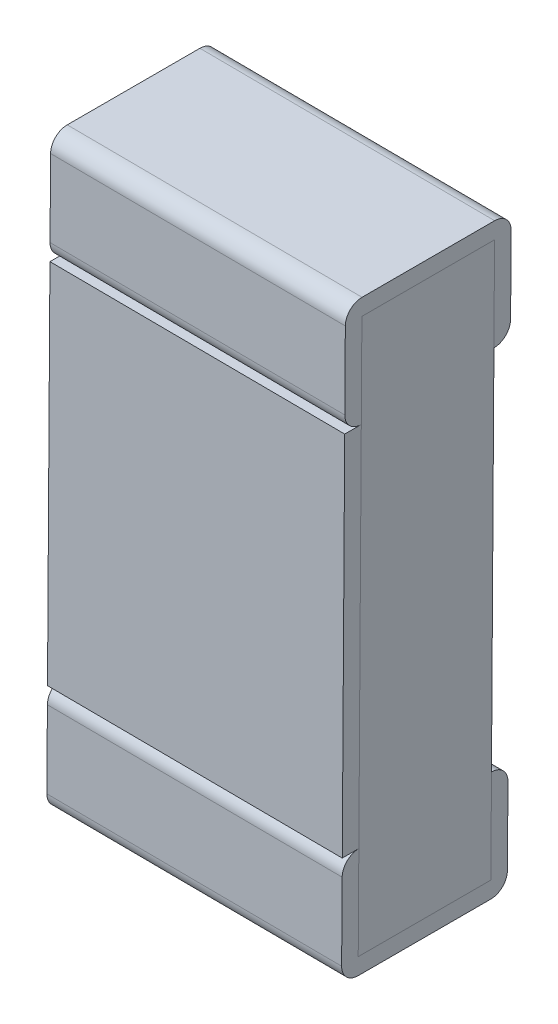
ISO-10303-21;
HEADER;
FILE_DESCRIPTION(('STEP AP214'),'2;1');
FILE_NAME('part.step','',(''),(''),'','','');
FILE_SCHEMA(('AUTOMOTIVE_DESIGN { 1 0 10303 214 1 1 1 1 }'));
ENDSEC;
DATA;
#1=APPLICATION_CONTEXT('core data for automotive mechanical design processes');
#2=APPLICATION_PROTOCOL_DEFINITION('international standard','automotive_design',2000,#1);
#3=PRODUCT_CONTEXT('',#1,'mechanical');
#4=PRODUCT('Part','Part','',(#3));
#5=PRODUCT_RELATED_PRODUCT_CATEGORY('part','',(#4));
#6=PRODUCT_DEFINITION_FORMATION('','',#4);
#7=PRODUCT_DEFINITION_CONTEXT('part definition',#1,'design');
#8=PRODUCT_DEFINITION('design','',#6,#7);
#9=PRODUCT_DEFINITION_SHAPE('','',#8);
#10=(LENGTH_UNIT() NAMED_UNIT(*) SI_UNIT(.MILLI.,.METRE.));
#11=(NAMED_UNIT(*) PLANE_ANGLE_UNIT() SI_UNIT($,.RADIAN.));
#12=(NAMED_UNIT(*) SI_UNIT($,.STERADIAN.) SOLID_ANGLE_UNIT());
#13=UNCERTAINTY_MEASURE_WITH_UNIT(LENGTH_MEASURE(1.E-05),#10,'distance_accuracy_value','');
#14=(GEOMETRIC_REPRESENTATION_CONTEXT(3) GLOBAL_UNCERTAINTY_ASSIGNED_CONTEXT((#13)) GLOBAL_UNIT_ASSIGNED_CONTEXT((#10,
#11,#12)) REPRESENTATION_CONTEXT('',''));
#15=CARTESIAN_POINT('',(0.,0.,0.));
#16=DIRECTION('',(0.,0.,1.));
#17=DIRECTION('',(1.,0.,0.));
#18=AXIS2_PLACEMENT_3D('',#15,#16,#17);
#19=CARTESIAN_POINT('',(212.691130229645,105.302320870175,142.661582908599));
#20=DIRECTION('',(0.,0.,1.));
#21=DIRECTION('',(1.,0.,0.));
#22=AXIS2_PLACEMENT_3D('',#19,#20,#21);
#23=PLANE('',#22);
#24=DIRECTION('',(-0.999978016708569,0.00663069374923689,0.));
#25=VECTOR('',#24,1.);
#26=CARTESIAN_POINT('',(212.691130229645,105.302320870175,142.661582908599));
#27=LINE('',#26,#25);
#28=CARTESIAN_POINT('',(212.691130229645,105.302320870175,142.661582908599));
#29=VERTEX_POINT('',#28);
#30=CARTESIAN_POINT('',(211.891147816278,105.307625425175,142.661582908599));
#31=VERTEX_POINT('',#30);
#32=EDGE_CURVE('E67',#29,#31,#27,.T.);
#33=ORIENTED_EDGE('',*,*,#32,.F.);
#34=DIRECTION('',(0.00663069374923689,0.999978016708569,0.));
#35=VECTOR('',#34,1.);
#36=CARTESIAN_POINT('',(212.691130229645,105.302320870175,142.661582908599));
#37=LINE('',#36,#35);
#38=CARTESIAN_POINT('',(212.697760923394,106.302298886884,142.661582908599));
#39=VERTEX_POINT('',#38);
#40=EDGE_CURVE('E11',#29,#39,#37,.T.);
#41=ORIENTED_EDGE('',*,*,#40,.T.);
#42=DIRECTION('',(-0.999978016708569,0.00663069374923689,0.));
#43=VECTOR('',#42,1.);
#44=CARTESIAN_POINT('',(212.697760923394,106.302298886884,142.661582908599));
#45=LINE('',#44,#43);
#46=CARTESIAN_POINT('',(211.897778510027,106.307603441883,142.661582908599));
#47=VERTEX_POINT('',#46);
#48=EDGE_CURVE('E55',#39,#47,#45,.T.);
#49=ORIENTED_EDGE('',*,*,#48,.T.);
#50=DIRECTION('',(0.00663069374923689,0.999978016708569,0.));
#51=VECTOR('',#50,1.);
#52=CARTESIAN_POINT('',(211.891147816278,105.307625425175,142.661582908599));
#53=LINE('',#52,#51);
#54=EDGE_CURVE('E311',#31,#47,#53,.T.);
#55=ORIENTED_EDGE('',*,*,#54,.F.);
#56=EDGE_LOOP('',(#33,#41,#49,#55));
#57=FACE_BOUND('',#56,.T.);
#58=ADVANCED_FACE('F44',(#57),#23,.T.);
#59=CARTESIAN_POINT('',(212.697760923394,106.302298886884,142.616582908599));
#60=DIRECTION('',(0.00663069374923689,0.99997801670857,0.));
#61=DIRECTION('',(0.,0.,-1.));
#62=AXIS2_PLACEMENT_3D('',#59,#60,#61);
#63=PLANE('',#62);
#64=DIRECTION('',(0.,0.,1.));
#65=VECTOR('',#64,1.);
#66=CARTESIAN_POINT('',(212.697760923394,106.302298886884,142.616582908599));
#67=LINE('',#66,#65);
#68=CARTESIAN_POINT('',(212.697760923394,106.302298886884,142.616582908599));
#69=VERTEX_POINT('',#68);
#70=EDGE_CURVE('E387',#69,#39,#67,.T.);
#71=ORIENTED_EDGE('',*,*,#70,.F.);
#72=DIRECTION('',(-0.999978016708569,0.00663069374923689,0.));
#73=VECTOR('',#72,1.);
#74=CARTESIAN_POINT('',(212.697760923394,106.302298886884,142.616582908599));
#75=LINE('',#74,#73);
#76=CARTESIAN_POINT('',(211.897778510027,106.307603441883,142.616582908599));
#77=VERTEX_POINT('',#76);
#78=EDGE_CURVE('E349',#69,#77,#75,.T.);
#79=ORIENTED_EDGE('',*,*,#78,.T.);
#80=DIRECTION('',(0.,0.,1.));
#81=VECTOR('',#80,1.);
#82=CARTESIAN_POINT('',(211.897778510027,106.307603441883,142.616582908599));
#83=LINE('',#82,#81);
#84=EDGE_CURVE('E345',#77,#47,#83,.T.);
#85=ORIENTED_EDGE('',*,*,#84,.T.);
#86=ORIENTED_EDGE('',*,*,#48,.F.);
#87=EDGE_LOOP('',(#71,#79,#85,#86));
#88=FACE_BOUND('',#87,.T.);
#89=ADVANCED_FACE('F568',(#88),#63,.T.);
#90=CARTESIAN_POINT('',(212.698059304613,106.347297897636,142.616582908599));
#91=DIRECTION('',(-0.999978016708571,0.00663069374900344,0.));
#92=DIRECTION('',(-0.00663069374900344,-0.999978016708571,0.));
#93=AXIS2_PLACEMENT_3D('',#90,#91,#92);
#94=CYLINDRICAL_SURFACE('',#93,0.0450000000000037);
#95=CARTESIAN_POINT('',(212.698059304613,106.347297897636,142.616582908599));
#96=DIRECTION('',(-0.99997801670857,0.00663069374923689,0.));
#97=DIRECTION('',(0.,0.,1.));
#98=AXIS2_PLACEMENT_3D('',#95,#96,#97);
#99=CIRCLE('',#98,0.0449999999999895);
#100=CARTESIAN_POINT('',(212.698059304613,106.347297897636,142.661582908599));
#101=VERTEX_POINT('',#100);
#102=EDGE_CURVE('E350',#69,#101,#99,.T.);
#103=ORIENTED_EDGE('',*,*,#102,.T.);
#104=DIRECTION('',(-0.999978016708569,0.00663069374923689,0.));
#105=VECTOR('',#104,1.);
#106=CARTESIAN_POINT('',(212.698059304613,106.347297897636,142.661582908599));
#107=LINE('',#106,#105);
#108=CARTESIAN_POINT('',(211.898076891246,106.352602452635,142.661582908599));
#109=VERTEX_POINT('',#108);
#110=EDGE_CURVE('E343',#101,#109,#107,.T.);
#111=ORIENTED_EDGE('',*,*,#110,.T.);
#112=CARTESIAN_POINT('',(211.898076891246,106.352602452635,142.616582908599));
#113=DIRECTION('',(-0.99997801670857,0.00663069374923689,0.));
#114=DIRECTION('',(0.,0.,1.));
#115=AXIS2_PLACEMENT_3D('',#112,#113,#114);
#116=CIRCLE('',#115,0.0449999999999895);
#117=EDGE_CURVE('E279',#77,#109,#116,.T.);
#118=ORIENTED_EDGE('',*,*,#117,.F.);
#119=ORIENTED_EDGE('',*,*,#78,.F.);
#120=EDGE_LOOP('',(#103,#111,#118,#119));
#121=FACE_BOUND('',#120,.T.);
#122=ADVANCED_FACE('F444',(#121),#94,.T.);
#123=CARTESIAN_POINT('',(212.697760923394,106.302298886884,142.661582908599));
#124=DIRECTION('',(0.,0.,1.));
#125=DIRECTION('',(1.,0.,0.));
#126=AXIS2_PLACEMENT_3D('',#123,#124,#125);
#127=PLANE('',#126);
#128=DIRECTION('',(0.00663069374923689,0.999978016708569,0.));
#129=VECTOR('',#128,1.);
#130=CARTESIAN_POINT('',(211.897778510027,106.307603441883,142.661582908599));
#131=LINE('',#130,#129);
#132=CARTESIAN_POINT('',(211.899469336934,106.562597836144,142.661582908599));
#133=VERTEX_POINT('',#132);
#134=EDGE_CURVE('E307',#109,#133,#131,.T.);
#135=ORIENTED_EDGE('',*,*,#134,.F.);
#136=ORIENTED_EDGE('',*,*,#110,.F.);
#137=DIRECTION('',(0.00663069374923689,0.999978016708569,0.));
#138=VECTOR('',#137,1.);
#139=CARTESIAN_POINT('',(212.697760923394,106.302298886884,142.661582908599));
#140=LINE('',#139,#138);
#141=CARTESIAN_POINT('',(212.6994517503,106.557293281145,142.661582908599));
#142=VERTEX_POINT('',#141);
#143=EDGE_CURVE('E339',#101,#142,#140,.T.);
#144=ORIENTED_EDGE('',*,*,#143,.T.);
#145=DIRECTION('',(-0.999978016708569,0.00663069374923689,0.));
#146=VECTOR('',#145,1.);
#147=CARTESIAN_POINT('',(212.6994517503,106.557293281145,142.661582908599));
#148=LINE('',#147,#146);
#149=EDGE_CURVE('E344',#142,#133,#148,.T.);
#150=ORIENTED_EDGE('',*,*,#149,.T.);
#151=EDGE_LOOP('',(#135,#136,#144,#150));
#152=FACE_BOUND('',#151,.T.);
#153=ADVANCED_FACE('F458',(#152),#127,.T.);
#154=CARTESIAN_POINT('',(212.6994517503,106.557293281145,142.616582908599));
#155=DIRECTION('',(-0.999978016708571,0.00663069374900344,0.));
#156=DIRECTION('',(0.00663069374900344,0.999978016708571,0.));
#157=AXIS2_PLACEMENT_3D('',#154,#155,#156);
#158=CYLINDRICAL_SURFACE('',#157,0.0450000000000037);
#159=DIRECTION('',(-0.999978016708569,0.00663069374923689,0.));
#160=VECTOR('',#159,1.);
#161=CARTESIAN_POINT('',(212.699750131519,106.602292291897,142.616582908599));
#162=LINE('',#161,#160);
#163=CARTESIAN_POINT('',(212.699750131519,106.602292291897,142.616582908599));
#164=VERTEX_POINT('',#163);
#165=CARTESIAN_POINT('',(211.899767718152,106.607596846896,142.616582908599));
#166=VERTEX_POINT('',#165);
#167=EDGE_CURVE('E410',#164,#166,#162,.T.);
#168=ORIENTED_EDGE('',*,*,#167,.T.);
#169=CARTESIAN_POINT('',(211.899469336934,106.562597836144,142.616582908599));
#170=DIRECTION('',(0.99997801670857,-0.00663069374923689,0.));
#171=DIRECTION('',(0.,0.,1.));
#172=AXIS2_PLACEMENT_3D('',#169,#170,#171);
#173=CIRCLE('',#172,0.0449999999999895);
#174=EDGE_CURVE('E303',#166,#133,#173,.T.);
#175=ORIENTED_EDGE('',*,*,#174,.T.);
#176=ORIENTED_EDGE('',*,*,#149,.F.);
#177=CARTESIAN_POINT('',(212.6994517503,106.557293281145,142.616582908599));
#178=DIRECTION('',(0.99997801670857,-0.00663069374923689,0.));
#179=DIRECTION('',(0.,0.,1.));
#180=AXIS2_PLACEMENT_3D('',#177,#178,#179);
#181=CIRCLE('',#180,0.0449999999999895);
#182=EDGE_CURVE('E421',#164,#142,#181,.T.);
#183=ORIENTED_EDGE('',*,*,#182,.F.);
#184=EDGE_LOOP('',(#168,#175,#176,#183));
#185=FACE_BOUND('',#184,.T.);
#186=ADVANCED_FACE('F46',(#185),#158,.T.);
#187=CARTESIAN_POINT('',(212.699750131519,106.602292291897,142.211582908599));
#188=DIRECTION('',(0.00663069374923689,0.99997801670857,0.));
#189=DIRECTION('',(0.,0.,-1.));
#190=AXIS2_PLACEMENT_3D('',#187,#188,#189);
#191=PLANE('',#190);
#192=DIRECTION('',(0.,0.,1.));
#193=VECTOR('',#192,1.);
#194=CARTESIAN_POINT('',(212.699750131519,106.602292291897,142.211582908599));
#195=LINE('',#194,#193);
#196=CARTESIAN_POINT('',(212.699750131519,106.602292291897,142.256582908599));
#197=VERTEX_POINT('',#196);
#198=EDGE_CURVE('E48',#197,#164,#195,.T.);
#199=ORIENTED_EDGE('',*,*,#198,.F.);
#200=DIRECTION('',(-0.999978016708569,0.00663069374923689,0.));
#201=VECTOR('',#200,1.);
#202=CARTESIAN_POINT('',(212.699750131519,106.602292291897,142.256582908599));
#203=LINE('',#202,#201);
#204=CARTESIAN_POINT('',(211.899767718152,106.607596846896,142.256582908599));
#205=VERTEX_POINT('',#204);
#206=EDGE_CURVE('E299',#197,#205,#203,.T.);
#207=ORIENTED_EDGE('',*,*,#206,.T.);
#208=DIRECTION('',(0.,0.,1.));
#209=VECTOR('',#208,1.);
#210=CARTESIAN_POINT('',(211.899767718152,106.607596846896,142.211582908599));
#211=LINE('',#210,#209);
#212=EDGE_CURVE('E304',#205,#166,#211,.T.);
#213=ORIENTED_EDGE('',*,*,#212,.T.);
#214=ORIENTED_EDGE('',*,*,#167,.F.);
#215=EDGE_LOOP('',(#199,#207,#213,#214));
#216=FACE_BOUND('',#215,.T.);
#217=ADVANCED_FACE('F584',(#216),#191,.T.);
#218=CARTESIAN_POINT('',(212.6994517503,106.557293281145,142.256582908599));
#219=DIRECTION('',(-0.999978016708571,0.00663069374900344,0.));
#220=DIRECTION('',(0.00663069374900344,0.999978016708571,0.));
#221=AXIS2_PLACEMENT_3D('',#218,#219,#220);
#222=CYLINDRICAL_SURFACE('',#221,0.0450000000000037);
#223=CARTESIAN_POINT('',(212.6994517503,106.557293281145,142.256582908599));
#224=DIRECTION('',(-0.99997801670857,0.00663069374923689,0.));
#225=DIRECTION('',(0.,0.,1.));
#226=AXIS2_PLACEMENT_3D('',#223,#224,#225);
#227=CIRCLE('',#226,0.0449999999999895);
#228=CARTESIAN_POINT('',(212.6994517503,106.557293281145,142.211582908599));
#229=VERTEX_POINT('',#228);
#230=EDGE_CURVE('E490',#197,#229,#227,.T.);
#231=ORIENTED_EDGE('',*,*,#230,.T.);
#232=DIRECTION('',(-0.999978016708569,0.00663069374923689,0.));
#233=VECTOR('',#232,1.);
#234=CARTESIAN_POINT('',(212.6994517503,106.557293281145,142.211582908599));
#235=LINE('',#234,#233);
#236=CARTESIAN_POINT('',(211.899469336934,106.562597836144,142.211582908599));
#237=VERTEX_POINT('',#236);
#238=EDGE_CURVE('E487',#229,#237,#235,.T.);
#239=ORIENTED_EDGE('',*,*,#238,.T.);
#240=CARTESIAN_POINT('',(211.899469336934,106.562597836144,142.256582908599));
#241=DIRECTION('',(-0.99997801670857,0.00663069374923689,0.));
#242=DIRECTION('',(0.,0.,1.));
#243=AXIS2_PLACEMENT_3D('',#240,#241,#242);
#244=CIRCLE('',#243,0.0449999999999895);
#245=EDGE_CURVE('E309',#205,#237,#244,.T.);
#246=ORIENTED_EDGE('',*,*,#245,.F.);
#247=ORIENTED_EDGE('',*,*,#206,.F.);
#248=EDGE_LOOP('',(#231,#239,#246,#247));
#249=FACE_BOUND('',#248,.T.);
#250=ADVANCED_FACE('F502',(#249),#222,.T.);
#251=CARTESIAN_POINT('',(212.697760923394,106.302298886884,142.211582908599));
#252=DIRECTION('',(0.,0.,1.));
#253=DIRECTION('',(1.,0.,0.));
#254=AXIS2_PLACEMENT_3D('',#251,#252,#253);
#255=PLANE('',#254);
#256=ORIENTED_EDGE('',*,*,#238,.F.);
#257=DIRECTION('',(0.00663069374923689,0.999978016708569,0.));
#258=VECTOR('',#257,1.);
#259=CARTESIAN_POINT('',(212.697760923394,106.302298886884,142.211582908599));
#260=LINE('',#259,#258);
#261=CARTESIAN_POINT('',(212.698059304613,106.347297897636,142.211582908599));
#262=VERTEX_POINT('',#261);
#263=EDGE_CURVE('E359',#262,#229,#260,.T.);
#264=ORIENTED_EDGE('',*,*,#263,.F.);
#265=DIRECTION('',(-0.999978016708569,0.00663069374923689,0.));
#266=VECTOR('',#265,1.);
#267=CARTESIAN_POINT('',(212.698059304613,106.347297897636,142.211582908599));
#268=LINE('',#267,#266);
#269=CARTESIAN_POINT('',(211.898076891246,106.352602452635,142.211582908599));
#270=VERTEX_POINT('',#269);
#271=EDGE_CURVE('E375',#262,#270,#268,.T.);
#272=ORIENTED_EDGE('',*,*,#271,.T.);
#273=DIRECTION('',(0.00663069374923689,0.999978016708569,0.));
#274=VECTOR('',#273,1.);
#275=CARTESIAN_POINT('',(211.897778510027,106.307603441883,142.211582908599));
#276=LINE('',#275,#274);
#277=EDGE_CURVE('E371',#270,#237,#276,.T.);
#278=ORIENTED_EDGE('',*,*,#277,.T.);
#279=EDGE_LOOP('',(#256,#264,#272,#278));
#280=FACE_BOUND('',#279,.T.);
#281=ADVANCED_FACE('F508',(#280),#255,.F.);
#282=CARTESIAN_POINT('',(212.698059304613,106.347297897636,142.256582908599));
#283=DIRECTION('',(-0.999978016708571,0.00663069374900344,0.));
#284=DIRECTION('',(-0.00663069374900344,-0.999978016708571,0.));
#285=AXIS2_PLACEMENT_3D('',#282,#283,#284);
#286=CYLINDRICAL_SURFACE('',#285,0.0450000000000037);
#287=DIRECTION('',(-0.999978016708569,0.00663069374923689,0.));
#288=VECTOR('',#287,1.);
#289=CARTESIAN_POINT('',(212.697760923394,106.302298886884,142.256582908599));
#290=LINE('',#289,#288);
#291=CARTESIAN_POINT('',(212.697760923394,106.302298886884,142.256582908599));
#292=VERTEX_POINT('',#291);
#293=CARTESIAN_POINT('',(211.897778510027,106.307603441883,142.256582908599));
#294=VERTEX_POINT('',#293);
#295=EDGE_CURVE('E376',#292,#294,#290,.T.);
#296=ORIENTED_EDGE('',*,*,#295,.T.);
#297=CARTESIAN_POINT('',(211.898076891246,106.352602452635,142.256582908599));
#298=DIRECTION('',(0.99997801670857,-0.00663069374923689,0.));
#299=DIRECTION('',(0.,0.,1.));
#300=AXIS2_PLACEMENT_3D('',#297,#298,#299);
#301=CIRCLE('',#300,0.0449999999999895);
#302=EDGE_CURVE('E321',#294,#270,#301,.T.);
#303=ORIENTED_EDGE('',*,*,#302,.T.);
#304=ORIENTED_EDGE('',*,*,#271,.F.);
#305=CARTESIAN_POINT('',(212.698059304613,106.347297897636,142.256582908599));
#306=DIRECTION('',(0.99997801670857,-0.00663069374923689,0.));
#307=DIRECTION('',(0.,0.,1.));
#308=AXIS2_PLACEMENT_3D('',#305,#306,#307);
#309=CIRCLE('',#308,0.0449999999999895);
#310=EDGE_CURVE('E400',#292,#262,#309,.T.);
#311=ORIENTED_EDGE('',*,*,#310,.F.);
#312=EDGE_LOOP('',(#296,#303,#304,#311));
#313=FACE_BOUND('',#312,.T.);
#314=ADVANCED_FACE('F511',(#313),#286,.T.);
#315=CARTESIAN_POINT('',(211.891147816278,105.307625425175,142.616582908599));
#316=DIRECTION('',(-0.99997801670857,0.00663069374923689,0.));
#317=DIRECTION('',(0.,0.,1.));
#318=AXIS2_PLACEMENT_3D('',#315,#316,#317);
#319=PLANE('',#318);
#320=DIRECTION('',(0.00663069374923689,0.999978016708569,0.));
#321=VECTOR('',#320,1.);
#322=CARTESIAN_POINT('',(211.891147816278,105.307625425175,142.616582908599));
#323=LINE('',#322,#321);
#324=CARTESIAN_POINT('',(211.891147816278,105.307625425175,142.616582908599));
#325=VERTEX_POINT('',#324);
#326=EDGE_CURVE('E284',#325,#77,#323,.T.);
#327=ORIENTED_EDGE('',*,*,#326,.F.);
#328=DIRECTION('',(0.,0.,1.));
#329=VECTOR('',#328,1.);
#330=CARTESIAN_POINT('',(211.891147816278,105.307625425175,142.616582908599));
#331=LINE('',#330,#329);
#332=EDGE_CURVE('E313',#325,#31,#331,.T.);
#333=ORIENTED_EDGE('',*,*,#332,.T.);
#334=ORIENTED_EDGE('',*,*,#54,.T.);
#335=ORIENTED_EDGE('',*,*,#84,.F.);
#336=EDGE_LOOP('',(#327,#333,#334,#335));
#337=FACE_BOUND('',#336,.T.);
#338=ADVANCED_FACE('F596',(#337),#319,.T.);
#339=CARTESIAN_POINT('',(211.897778510027,106.307603441883,142.211582908599));
#340=DIRECTION('',(-0.99997801670857,0.00663069374923689,0.));
#341=DIRECTION('',(0.,0.,1.));
#342=AXIS2_PLACEMENT_3D('',#339,#340,#341);
#343=PLANE('',#342);
#344=ORIENTED_EDGE('',*,*,#277,.F.);
#345=ORIENTED_EDGE('',*,*,#302,.F.);
#346=DIRECTION('',(0.00663069374923689,0.999978016708569,0.));
#347=VECTOR('',#346,1.);
#348=CARTESIAN_POINT('',(211.889456989372,105.052631030914,142.256582908599));
#349=LINE('',#348,#347);
#350=CARTESIAN_POINT('',(211.899469336934,106.562597836144,142.256582908599));
#351=VERTEX_POINT('',#350);
#352=EDGE_CURVE('E278',#294,#351,#349,.T.);
#353=ORIENTED_EDGE('',*,*,#352,.T.);
#354=DIRECTION('',(0.,0.,1.));
#355=VECTOR('',#354,1.);
#356=CARTESIAN_POINT('',(211.899469336934,106.562597836144,142.256582908599));
#357=LINE('',#356,#355);
#358=CARTESIAN_POINT('',(211.899469336934,106.562597836144,142.616582908599));
#359=VERTEX_POINT('',#358);
#360=EDGE_CURVE('E276',#351,#359,#357,.T.);
#361=ORIENTED_EDGE('',*,*,#360,.T.);
#362=DIRECTION('',(0.00663069374923689,0.999978016708569,0.));
#363=VECTOR('',#362,1.);
#364=CARTESIAN_POINT('',(211.889456989372,105.052631030914,142.616582908599));
#365=LINE('',#364,#363);
#366=EDGE_CURVE('E280',#77,#359,#365,.T.);
#367=ORIENTED_EDGE('',*,*,#366,.F.);
#368=ORIENTED_EDGE('',*,*,#117,.T.);
#369=ORIENTED_EDGE('',*,*,#134,.T.);
#370=ORIENTED_EDGE('',*,*,#174,.F.);
#371=ORIENTED_EDGE('',*,*,#212,.F.);
#372=ORIENTED_EDGE('',*,*,#245,.T.);
#373=EDGE_LOOP('',(#344,#345,#353,#361,#367,#368,#369,#370,#371,#372));
#374=FACE_BOUND('',#373,.T.);
#375=ADVANCED_FACE('F544',(#374),#343,.T.);
#376=CARTESIAN_POINT('',(212.691130229645,105.302320870175,142.616582908599));
#377=DIRECTION('',(0.00663069374923689,0.99997801670857,0.));
#378=DIRECTION('',(0.,0.,-1.));
#379=AXIS2_PLACEMENT_3D('',#376,#377,#378);
#380=PLANE('',#379);
#381=ORIENTED_EDGE('',*,*,#32,.T.);
#382=ORIENTED_EDGE('',*,*,#332,.F.);
#383=DIRECTION('',(-0.999978016708569,0.00663069374923689,0.));
#384=VECTOR('',#383,1.);
#385=CARTESIAN_POINT('',(212.691130229645,105.302320870175,142.616582908599));
#386=LINE('',#385,#384);
#387=CARTESIAN_POINT('',(212.691130229645,105.302320870175,142.616582908599));
#388=VERTEX_POINT('',#387);
#389=EDGE_CURVE('E285',#388,#325,#386,.T.);
#390=ORIENTED_EDGE('',*,*,#389,.F.);
#391=DIRECTION('',(0.,0.,1.));
#392=VECTOR('',#391,1.);
#393=CARTESIAN_POINT('',(212.691130229645,105.302320870175,142.616582908599));
#394=LINE('',#393,#392);
#395=EDGE_CURVE('E310',#388,#29,#394,.T.);
#396=ORIENTED_EDGE('',*,*,#395,.T.);
#397=EDGE_LOOP('',(#381,#382,#390,#396));
#398=FACE_BOUND('',#397,.T.);
#399=ADVANCED_FACE('F589',(#398),#380,.F.);
#400=CARTESIAN_POINT('',(212.691130229645,105.302320870175,142.616582908599));
#401=DIRECTION('',(-0.99997801670857,0.00663069374923689,0.));
#402=DIRECTION('',(0.,0.,1.));
#403=AXIS2_PLACEMENT_3D('',#400,#401,#402);
#404=PLANE('',#403);
#405=ORIENTED_EDGE('',*,*,#70,.T.);
#406=ORIENTED_EDGE('',*,*,#40,.F.);
#407=ORIENTED_EDGE('',*,*,#395,.F.);
#408=DIRECTION('',(0.00663069374923689,0.999978016708569,0.));
#409=VECTOR('',#408,1.);
#410=CARTESIAN_POINT('',(212.691130229645,105.302320870175,142.616582908599));
#411=LINE('',#410,#409);
#412=EDGE_CURVE('E383',#388,#69,#411,.T.);
#413=ORIENTED_EDGE('',*,*,#412,.T.);
#414=EDGE_LOOP('',(#405,#406,#407,#413));
#415=FACE_BOUND('',#414,.T.);
#416=ADVANCED_FACE('F592',(#415),#404,.F.);
#417=CARTESIAN_POINT('',(212.697760923394,106.302298886884,142.211582908599));
#418=DIRECTION('',(-0.99997801670857,0.00663069374923689,0.));
#419=DIRECTION('',(0.,0.,1.));
#420=AXIS2_PLACEMENT_3D('',#417,#418,#419);
#421=PLANE('',#420);
#422=ORIENTED_EDGE('',*,*,#230,.F.);
#423=ORIENTED_EDGE('',*,*,#198,.T.);
#424=ORIENTED_EDGE('',*,*,#182,.T.);
#425=ORIENTED_EDGE('',*,*,#143,.F.);
#426=ORIENTED_EDGE('',*,*,#102,.F.);
#427=DIRECTION('',(0.00663069374923689,0.999978016708569,0.));
#428=VECTOR('',#427,1.);
#429=CARTESIAN_POINT('',(212.689439402739,105.047326475915,142.616582908599));
#430=LINE('',#429,#428);
#431=CARTESIAN_POINT('',(212.6994517503,106.557293281145,142.616582908599));
#432=VERTEX_POINT('',#431);
#433=EDGE_CURVE('E418',#69,#432,#430,.T.);
#434=ORIENTED_EDGE('',*,*,#433,.T.);
#435=DIRECTION('',(0.,0.,1.));
#436=VECTOR('',#435,1.);
#437=CARTESIAN_POINT('',(212.6994517503,106.557293281145,142.256582908599));
#438=LINE('',#437,#436);
#439=CARTESIAN_POINT('',(212.6994517503,106.557293281145,142.256582908599));
#440=VERTEX_POINT('',#439);
#441=EDGE_CURVE('E363',#440,#432,#438,.T.);
#442=ORIENTED_EDGE('',*,*,#441,.F.);
#443=DIRECTION('',(0.00663069374923689,0.999978016708569,0.));
#444=VECTOR('',#443,1.);
#445=CARTESIAN_POINT('',(212.689439402739,105.047326475915,142.256582908599));
#446=LINE('',#445,#444);
#447=EDGE_CURVE('E382',#292,#440,#446,.T.);
#448=ORIENTED_EDGE('',*,*,#447,.F.);
#449=ORIENTED_EDGE('',*,*,#310,.T.);
#450=ORIENTED_EDGE('',*,*,#263,.T.);
#451=EDGE_LOOP('',(#422,#423,#424,#425,#426,#434,#442,#448,#449,#450));
#452=FACE_BOUND('',#451,.T.);
#453=ADVANCED_FACE('F455',(#452),#421,.F.);
#454=CARTESIAN_POINT('',(212.689439402739,105.047326475915,142.256582908599));
#455=DIRECTION('',(0.,0.,1.));
#456=DIRECTION('',(1.,0.,0.));
#457=AXIS2_PLACEMENT_3D('',#454,#455,#456);
#458=PLANE('',#457);
#459=DIRECTION('',(0.00663069374923689,0.999978016708569,0.));
#460=VECTOR('',#459,1.);
#461=CARTESIAN_POINT('',(211.889456989372,105.052631030914,142.256582908599));
#462=LINE('',#461,#460);
#463=CARTESIAN_POINT('',(211.891147816278,105.307625425175,142.256582908599));
#464=VERTEX_POINT('',#463);
#465=EDGE_CURVE('E337',#464,#294,#462,.T.);
#466=ORIENTED_EDGE('',*,*,#465,.T.);
#467=ORIENTED_EDGE('',*,*,#295,.F.);
#468=DIRECTION('',(0.00663069374923689,0.999978016708569,0.));
#469=VECTOR('',#468,1.);
#470=CARTESIAN_POINT('',(212.689439402739,105.047326475915,142.256582908599));
#471=LINE('',#470,#469);
#472=CARTESIAN_POINT('',(212.691130229645,105.302320870175,142.256582908599));
#473=VERTEX_POINT('',#472);
#474=EDGE_CURVE('E395',#473,#292,#471,.T.);
#475=ORIENTED_EDGE('',*,*,#474,.F.);
#476=DIRECTION('',(-0.999978016708569,0.00663069374923689,0.));
#477=VECTOR('',#476,1.);
#478=CARTESIAN_POINT('',(212.691130229645,105.302320870175,142.256582908599));
#479=LINE('',#478,#477);
#480=EDGE_CURVE('E334',#473,#464,#479,.T.);
#481=ORIENTED_EDGE('',*,*,#480,.T.);
#482=EDGE_LOOP('',(#466,#467,#475,#481));
#483=FACE_BOUND('',#482,.T.);
#484=ADVANCED_FACE('F540',(#483),#458,.F.);
#485=CARTESIAN_POINT('',(211.889456989372,105.052631030914,142.256582908599));
#486=DIRECTION('',(-0.99997801670857,0.00663069374923689,0.));
#487=DIRECTION('',(0.,0.,1.));
#488=AXIS2_PLACEMENT_3D('',#485,#486,#487);
#489=PLANE('',#488);
#490=DIRECTION('',(0.00663069374923689,0.999978016708569,0.));
#491=VECTOR('',#490,1.);
#492=CARTESIAN_POINT('',(211.889456989372,105.052631030914,142.256582908599));
#493=LINE('',#492,#491);
#494=CARTESIAN_POINT('',(211.889456989372,105.052631030914,142.256582908599));
#495=VERTEX_POINT('',#494);
#496=EDGE_CURVE('E351',#495,#464,#493,.T.);
#497=ORIENTED_EDGE('',*,*,#496,.F.);
#498=DIRECTION('',(0.,0.,1.));
#499=VECTOR('',#498,1.);
#500=CARTESIAN_POINT('',(211.889456989372,105.052631030914,142.256582908599));
#501=LINE('',#500,#499);
#502=CARTESIAN_POINT('',(211.889456989372,105.052631030914,142.616582908599));
#503=VERTEX_POINT('',#502);
#504=EDGE_CURVE('E338',#495,#503,#501,.T.);
#505=ORIENTED_EDGE('',*,*,#504,.T.);
#506=DIRECTION('',(0.00663069374923689,0.999978016708569,0.));
#507=VECTOR('',#506,1.);
#508=CARTESIAN_POINT('',(211.889456989372,105.052631030914,142.616582908599));
#509=LINE('',#508,#507);
#510=EDGE_CURVE('E274',#503,#325,#509,.T.);
#511=ORIENTED_EDGE('',*,*,#510,.T.);
#512=ORIENTED_EDGE('',*,*,#326,.T.);
#513=ORIENTED_EDGE('',*,*,#366,.T.);
#514=ORIENTED_EDGE('',*,*,#360,.F.);
#515=ORIENTED_EDGE('',*,*,#352,.F.);
#516=ORIENTED_EDGE('',*,*,#465,.F.);
#517=EDGE_LOOP('',(#497,#505,#511,#512,#513,#514,#515,#516));
#518=FACE_BOUND('',#517,.T.);
#519=ADVANCED_FACE('F542',(#518),#489,.T.);
#520=CARTESIAN_POINT('',(212.690831848426,105.257321859424,142.616582908599));
#521=DIRECTION('',(-0.999978016708571,0.00663069374900344,0.));
#522=DIRECTION('',(0.00663069374900344,0.999978016708571,0.));
#523=AXIS2_PLACEMENT_3D('',#520,#521,#522);
#524=CYLINDRICAL_SURFACE('',#523,0.0450000000000037);
#525=ORIENTED_EDGE('',*,*,#389,.T.);
#526=CARTESIAN_POINT('',(211.89084943506,105.262626414423,142.616582908599));
#527=DIRECTION('',(0.99997801670857,-0.00663069374923689,0.));
#528=DIRECTION('',(0.,0.,1.));
#529=AXIS2_PLACEMENT_3D('',#526,#527,#528);
#530=CIRCLE('',#529,0.0449999999999895);
#531=CARTESIAN_POINT('',(211.89084943506,105.262626414423,142.661582908599));
#532=VERTEX_POINT('',#531);
#533=EDGE_CURVE('E297',#325,#532,#530,.T.);
#534=ORIENTED_EDGE('',*,*,#533,.T.);
#535=DIRECTION('',(-0.999978016708569,0.00663069374923689,0.));
#536=VECTOR('',#535,1.);
#537=CARTESIAN_POINT('',(212.690831848426,105.257321859424,142.661582908599));
#538=LINE('',#537,#536);
#539=CARTESIAN_POINT('',(212.690831848426,105.257321859424,142.661582908599));
#540=VERTEX_POINT('',#539);
#541=EDGE_CURVE('E298',#540,#532,#538,.T.);
#542=ORIENTED_EDGE('',*,*,#541,.F.);
#543=CARTESIAN_POINT('',(212.690831848426,105.257321859424,142.616582908599));
#544=DIRECTION('',(0.99997801670857,-0.00663069374923689,0.));
#545=DIRECTION('',(0.,0.,1.));
#546=AXIS2_PLACEMENT_3D('',#543,#544,#545);
#547=CIRCLE('',#546,0.0449999999999895);
#548=EDGE_CURVE('E247',#388,#540,#547,.T.);
#549=ORIENTED_EDGE('',*,*,#548,.F.);
#550=EDGE_LOOP('',(#525,#534,#542,#549));
#551=FACE_BOUND('',#550,.T.);
#552=ADVANCED_FACE('F551',(#551),#524,.T.);
#553=CARTESIAN_POINT('',(212.68914102152,105.002327465163,142.661582908599));
#554=DIRECTION('',(0.,0.,1.));
#555=DIRECTION('',(1.,0.,0.));
#556=AXIS2_PLACEMENT_3D('',#553,#554,#555);
#557=PLANE('',#556);
#558=DIRECTION('',(0.00663069374923689,0.999978016708569,0.));
#559=VECTOR('',#558,1.);
#560=CARTESIAN_POINT('',(211.889158608153,105.007632020162,142.661582908599));
#561=LINE('',#560,#559);
#562=CARTESIAN_POINT('',(211.889456989372,105.052631030914,142.661582908599));
#563=VERTEX_POINT('',#562);
#564=EDGE_CURVE('E354',#563,#532,#561,.T.);
#565=ORIENTED_EDGE('',*,*,#564,.F.);
#566=DIRECTION('',(-0.999978016708569,0.00663069374923689,0.));
#567=VECTOR('',#566,1.);
#568=CARTESIAN_POINT('',(212.689439402739,105.047326475915,142.661582908599));
#569=LINE('',#568,#567);
#570=CARTESIAN_POINT('',(212.689439402739,105.047326475915,142.661582908599));
#571=VERTEX_POINT('',#570);
#572=EDGE_CURVE('E258',#571,#563,#569,.T.);
#573=ORIENTED_EDGE('',*,*,#572,.F.);
#574=DIRECTION('',(0.00663069374923689,0.999978016708569,0.));
#575=VECTOR('',#574,1.);
#576=CARTESIAN_POINT('',(212.68914102152,105.002327465163,142.661582908599));
#577=LINE('',#576,#575);
#578=EDGE_CURVE('E293',#571,#540,#577,.T.);
#579=ORIENTED_EDGE('',*,*,#578,.T.);
#580=ORIENTED_EDGE('',*,*,#541,.T.);
#581=EDGE_LOOP('',(#565,#573,#579,#580));
#582=FACE_BOUND('',#581,.T.);
#583=ADVANCED_FACE('F555',(#582),#557,.T.);
#584=CARTESIAN_POINT('',(212.689439402739,105.047326475915,142.256582908599));
#585=DIRECTION('',(-0.99997801670857,0.00663069374923689,0.));
#586=DIRECTION('',(0.,0.,1.));
#587=AXIS2_PLACEMENT_3D('',#584,#585,#586);
#588=PLANE('',#587);
#589=ORIENTED_EDGE('',*,*,#474,.T.);
#590=ORIENTED_EDGE('',*,*,#447,.T.);
#591=ORIENTED_EDGE('',*,*,#441,.T.);
#592=ORIENTED_EDGE('',*,*,#433,.F.);
#593=ORIENTED_EDGE('',*,*,#412,.F.);
#594=DIRECTION('',(0.00663069374923689,0.999978016708569,0.));
#595=VECTOR('',#594,1.);
#596=CARTESIAN_POINT('',(212.689439402739,105.047326475915,142.616582908599));
#597=LINE('',#596,#595);
#598=CARTESIAN_POINT('',(212.689439402739,105.047326475915,142.616582908599));
#599=VERTEX_POINT('',#598);
#600=EDGE_CURVE('E365',#599,#388,#597,.T.);
#601=ORIENTED_EDGE('',*,*,#600,.F.);
#602=DIRECTION('',(0.,0.,1.));
#603=VECTOR('',#602,1.);
#604=CARTESIAN_POINT('',(212.689439402739,105.047326475915,142.256582908599));
#605=LINE('',#604,#603);
#606=CARTESIAN_POINT('',(212.689439402739,105.047326475915,142.256582908599));
#607=VERTEX_POINT('',#606);
#608=EDGE_CURVE('E288',#607,#599,#605,.T.);
#609=ORIENTED_EDGE('',*,*,#608,.F.);
#610=DIRECTION('',(0.00663069374923689,0.999978016708569,0.));
#611=VECTOR('',#610,1.);
#612=CARTESIAN_POINT('',(212.689439402739,105.047326475915,142.256582908599));
#613=LINE('',#612,#611);
#614=EDGE_CURVE('E360',#607,#473,#613,.T.);
#615=ORIENTED_EDGE('',*,*,#614,.T.);
#616=EDGE_LOOP('',(#589,#590,#591,#592,#593,#601,#609,#615));
#617=FACE_BOUND('',#616,.T.);
#618=ADVANCED_FACE('F546',(#617),#588,.F.);
#619=CARTESIAN_POINT('',(212.690831848426,105.257321859424,142.256582908599));
#620=DIRECTION('',(-0.999978016708571,0.00663069374900344,0.));
#621=DIRECTION('',(0.00663069374900344,0.999978016708571,0.));
#622=AXIS2_PLACEMENT_3D('',#619,#620,#621);
#623=CYLINDRICAL_SURFACE('',#622,0.0450000000000037);
#624=CARTESIAN_POINT('',(212.690831848426,105.257321859424,142.256582908599));
#625=DIRECTION('',(-0.99997801670857,0.00663069374923689,0.));
#626=DIRECTION('',(0.,0.,1.));
#627=AXIS2_PLACEMENT_3D('',#624,#625,#626);
#628=CIRCLE('',#627,0.0449999999999895);
#629=CARTESIAN_POINT('',(212.690831848426,105.257321859424,142.211582908599));
#630=VERTEX_POINT('',#629);
#631=EDGE_CURVE('E364',#473,#630,#628,.T.);
#632=ORIENTED_EDGE('',*,*,#631,.T.);
#633=DIRECTION('',(-0.999978016708569,0.00663069374923689,0.));
#634=VECTOR('',#633,1.);
#635=CARTESIAN_POINT('',(212.690831848426,105.257321859424,142.211582908599));
#636=LINE('',#635,#634);
#637=CARTESIAN_POINT('',(211.89084943506,105.262626414423,142.211582908599));
#638=VERTEX_POINT('',#637);
#639=EDGE_CURVE('E291',#630,#638,#636,.T.);
#640=ORIENTED_EDGE('',*,*,#639,.T.);
#641=CARTESIAN_POINT('',(211.89084943506,105.262626414423,142.256582908599));
#642=DIRECTION('',(-0.99997801670857,0.00663069374923689,0.));
#643=DIRECTION('',(0.,0.,1.));
#644=AXIS2_PLACEMENT_3D('',#641,#642,#643);
#645=CIRCLE('',#644,0.0449999999999895);
#646=EDGE_CURVE('E355',#464,#638,#645,.T.);
#647=ORIENTED_EDGE('',*,*,#646,.F.);
#648=ORIENTED_EDGE('',*,*,#480,.F.);
#649=EDGE_LOOP('',(#632,#640,#647,#648));
#650=FACE_BOUND('',#649,.T.);
#651=ADVANCED_FACE('F536',(#650),#623,.T.);
#652=CARTESIAN_POINT('',(212.68914102152,105.002327465163,142.211582908599));
#653=DIRECTION('',(0.,0.,1.));
#654=DIRECTION('',(1.,0.,0.));
#655=AXIS2_PLACEMENT_3D('',#652,#653,#654);
#656=PLANE('',#655);
#657=ORIENTED_EDGE('',*,*,#639,.F.);
#658=DIRECTION('',(0.00663069374923689,0.999978016708569,0.));
#659=VECTOR('',#658,1.);
#660=CARTESIAN_POINT('',(212.68914102152,105.002327465163,142.211582908599));
#661=LINE('',#660,#659);
#662=CARTESIAN_POINT('',(212.689439402739,105.047326475915,142.211582908599));
#663=VERTEX_POINT('',#662);
#664=EDGE_CURVE('E248',#663,#630,#661,.T.);
#665=ORIENTED_EDGE('',*,*,#664,.F.);
#666=DIRECTION('',(-0.999978016708569,0.00663069374923689,0.));
#667=VECTOR('',#666,1.);
#668=CARTESIAN_POINT('',(212.689439402739,105.047326475915,142.211582908599));
#669=LINE('',#668,#667);
#670=CARTESIAN_POINT('',(211.889456989372,105.052631030914,142.211582908599));
#671=VERTEX_POINT('',#670);
#672=EDGE_CURVE('E242',#663,#671,#669,.T.);
#673=ORIENTED_EDGE('',*,*,#672,.T.);
#674=DIRECTION('',(0.00663069374923689,0.999978016708569,0.));
#675=VECTOR('',#674,1.);
#676=CARTESIAN_POINT('',(211.889158608153,105.007632020162,142.211582908599));
#677=LINE('',#676,#675);
#678=EDGE_CURVE('E292',#671,#638,#677,.T.);
#679=ORIENTED_EDGE('',*,*,#678,.T.);
#680=EDGE_LOOP('',(#657,#665,#673,#679));
#681=FACE_BOUND('',#680,.T.);
#682=ADVANCED_FACE('F532',(#681),#656,.F.);
#683=CARTESIAN_POINT('',(211.889158608153,105.007632020162,142.211582908599));
#684=DIRECTION('',(-0.99997801670857,0.00663069374923689,0.));
#685=DIRECTION('',(0.,0.,1.));
#686=AXIS2_PLACEMENT_3D('',#683,#684,#685);
#687=PLANE('',#686);
#688=ORIENTED_EDGE('',*,*,#678,.F.);
#689=CARTESIAN_POINT('',(211.889456989372,105.052631030914,142.256582908599));
#690=DIRECTION('',(0.99997801670857,-0.00663069374923689,0.));
#691=DIRECTION('',(0.,0.,1.));
#692=AXIS2_PLACEMENT_3D('',#689,#690,#691);
#693=CIRCLE('',#692,0.0449999999999895);
#694=CARTESIAN_POINT('',(211.889158608153,105.007632020162,142.256582908599));
#695=VERTEX_POINT('',#694);
#696=EDGE_CURVE('E259',#695,#671,#693,.T.);
#697=ORIENTED_EDGE('',*,*,#696,.F.);
#698=DIRECTION('',(0.,0.,1.));
#699=VECTOR('',#698,1.);
#700=CARTESIAN_POINT('',(211.889158608153,105.007632020162,142.211582908599));
#701=LINE('',#700,#699);
#702=CARTESIAN_POINT('',(211.889158608153,105.007632020162,142.616582908599));
#703=VERTEX_POINT('',#702);
#704=EDGE_CURVE('E256',#695,#703,#701,.T.);
#705=ORIENTED_EDGE('',*,*,#704,.T.);
#706=CARTESIAN_POINT('',(211.889456989372,105.052631030914,142.616582908599));
#707=DIRECTION('',(-0.99997801670857,0.00663069374923689,0.));
#708=DIRECTION('',(0.,0.,1.));
#709=AXIS2_PLACEMENT_3D('',#706,#707,#708);
#710=CIRCLE('',#709,0.0449999999999895);
#711=EDGE_CURVE('E407',#703,#563,#710,.T.);
#712=ORIENTED_EDGE('',*,*,#711,.T.);
#713=ORIENTED_EDGE('',*,*,#564,.T.);
#714=ORIENTED_EDGE('',*,*,#533,.F.);
#715=ORIENTED_EDGE('',*,*,#510,.F.);
#716=ORIENTED_EDGE('',*,*,#504,.F.);
#717=ORIENTED_EDGE('',*,*,#496,.T.);
#718=ORIENTED_EDGE('',*,*,#646,.T.);
#719=EDGE_LOOP('',(#688,#697,#705,#712,#713,#714,#715,#716,#717,#718));
#720=FACE_BOUND('',#719,.T.);
#721=ADVANCED_FACE('F529',(#720),#687,.T.);
#722=CARTESIAN_POINT('',(212.689439402739,105.047326475915,142.616582908599));
#723=DIRECTION('',(-0.999978016708571,0.00663069374900344,0.));
#724=DIRECTION('',(-0.00663069374900344,-0.999978016708571,0.));
#725=AXIS2_PLACEMENT_3D('',#722,#723,#724);
#726=CYLINDRICAL_SURFACE('',#725,0.0450000000000037);
#727=CARTESIAN_POINT('',(212.689439402739,105.047326475915,142.616582908599));
#728=DIRECTION('',(-0.99997801670857,0.00663069374923689,0.));
#729=DIRECTION('',(0.,0.,1.));
#730=AXIS2_PLACEMENT_3D('',#727,#728,#729);
#731=CIRCLE('',#730,0.0449999999999895);
#732=CARTESIAN_POINT('',(212.68914102152,105.002327465163,142.616582908599));
#733=VERTEX_POINT('',#732);
#734=EDGE_CURVE('E264',#733,#571,#731,.T.);
#735=ORIENTED_EDGE('',*,*,#734,.T.);
#736=ORIENTED_EDGE('',*,*,#572,.T.);
#737=ORIENTED_EDGE('',*,*,#711,.F.);
#738=DIRECTION('',(-0.999978016708569,0.00663069374923689,0.));
#739=VECTOR('',#738,1.);
#740=CARTESIAN_POINT('',(212.68914102152,105.002327465163,142.616582908599));
#741=LINE('',#740,#739);
#742=EDGE_CURVE('E228',#733,#703,#741,.T.);
#743=ORIENTED_EDGE('',*,*,#742,.F.);
#744=EDGE_LOOP('',(#735,#736,#737,#743));
#745=FACE_BOUND('',#744,.T.);
#746=ADVANCED_FACE('F556',(#745),#726,.T.);
#747=CARTESIAN_POINT('',(212.689439402739,105.047326475915,142.256582908599));
#748=DIRECTION('',(-0.999978016708571,0.00663069374900344,0.));
#749=DIRECTION('',(-0.00663069374900344,-0.999978016708571,0.));
#750=AXIS2_PLACEMENT_3D('',#747,#748,#749);
#751=CYLINDRICAL_SURFACE('',#750,0.0450000000000037);
#752=DIRECTION('',(-0.999978016708569,0.00663069374923689,0.));
#753=VECTOR('',#752,1.);
#754=CARTESIAN_POINT('',(212.68914102152,105.002327465163,142.256582908599));
#755=LINE('',#754,#753);
#756=CARTESIAN_POINT('',(212.68914102152,105.002327465163,142.256582908599));
#757=VERTEX_POINT('',#756);
#758=EDGE_CURVE('E240',#757,#695,#755,.T.);
#759=ORIENTED_EDGE('',*,*,#758,.T.);
#760=ORIENTED_EDGE('',*,*,#696,.T.);
#761=ORIENTED_EDGE('',*,*,#672,.F.);
#762=CARTESIAN_POINT('',(212.689439402739,105.047326475915,142.256582908599));
#763=DIRECTION('',(0.99997801670857,-0.00663069374923689,0.));
#764=DIRECTION('',(0.,0.,1.));
#765=AXIS2_PLACEMENT_3D('',#762,#763,#764);
#766=CIRCLE('',#765,0.0449999999999895);
#767=EDGE_CURVE('E236',#757,#663,#766,.T.);
#768=ORIENTED_EDGE('',*,*,#767,.F.);
#769=EDGE_LOOP('',(#759,#760,#761,#768));
#770=FACE_BOUND('',#769,.T.);
#771=ADVANCED_FACE('F238',(#770),#751,.T.);
#772=CARTESIAN_POINT('',(212.68914102152,105.002327465163,142.211582908599));
#773=DIRECTION('',(-0.99997801670857,0.00663069374923689,0.));
#774=DIRECTION('',(0.,0.,1.));
#775=AXIS2_PLACEMENT_3D('',#772,#773,#774);
#776=PLANE('',#775);
#777=ORIENTED_EDGE('',*,*,#631,.F.);
#778=ORIENTED_EDGE('',*,*,#614,.F.);
#779=ORIENTED_EDGE('',*,*,#608,.T.);
#780=ORIENTED_EDGE('',*,*,#600,.T.);
#781=ORIENTED_EDGE('',*,*,#548,.T.);
#782=ORIENTED_EDGE('',*,*,#578,.F.);
#783=ORIENTED_EDGE('',*,*,#734,.F.);
#784=DIRECTION('',(0.,0.,1.));
#785=VECTOR('',#784,1.);
#786=CARTESIAN_POINT('',(212.68914102152,105.002327465163,142.211582908599));
#787=LINE('',#786,#785);
#788=EDGE_CURVE('E254',#757,#733,#787,.T.);
#789=ORIENTED_EDGE('',*,*,#788,.F.);
#790=ORIENTED_EDGE('',*,*,#767,.T.);
#791=ORIENTED_EDGE('',*,*,#664,.T.);
#792=EDGE_LOOP('',(#777,#778,#779,#780,#781,#782,#783,#789,#790,#791));
#793=FACE_BOUND('',#792,.T.);
#794=ADVANCED_FACE('F262',(#793),#776,.F.);
#795=CARTESIAN_POINT('',(212.68914102152,105.002327465163,142.211582908599));
#796=DIRECTION('',(0.00663069374923689,0.99997801670857,0.));
#797=DIRECTION('',(0.,0.,-1.));
#798=AXIS2_PLACEMENT_3D('',#795,#796,#797);
#799=PLANE('',#798);
#800=ORIENTED_EDGE('',*,*,#742,.T.);
#801=ORIENTED_EDGE('',*,*,#704,.F.);
#802=ORIENTED_EDGE('',*,*,#758,.F.);
#803=ORIENTED_EDGE('',*,*,#788,.T.);
#804=EDGE_LOOP('',(#800,#801,#802,#803));
#805=FACE_BOUND('',#804,.T.);
#806=ADVANCED_FACE('F253',(#805),#799,.F.);
#807=CLOSED_SHELL('',(#58,#89,#122,#153,#186,#217,#250,#281,#314,#338,#375,#399,#416,#453,#484,
#519,#552,#583,#618,#651,#682,#721,#746,#771,#794,#806));
#808=MANIFOLD_SOLID_BREP('B2',#807);
#809=ADVANCED_BREP_SHAPE_REPRESENTATION('',(#18,#808),#14);
#810=SHAPE_DEFINITION_REPRESENTATION(#9,#809);
ENDSEC;
END-ISO-10303-21;
